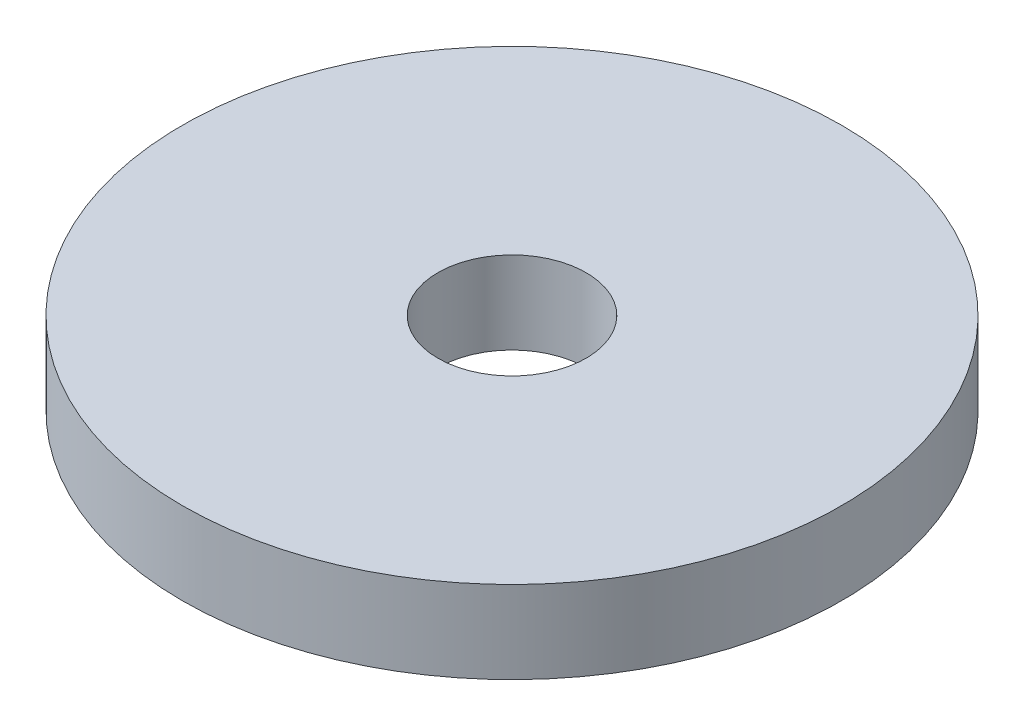
ISO-10303-21;
HEADER;
FILE_DESCRIPTION(('STEP AP214'),'2;1');
FILE_NAME('part.step','',(''),(''),'','','');
FILE_SCHEMA(('AUTOMOTIVE_DESIGN { 1 0 10303 214 1 1 1 1 }'));
ENDSEC;
DATA;
#1=APPLICATION_CONTEXT('core data for automotive mechanical design processes');
#2=APPLICATION_PROTOCOL_DEFINITION('international standard','automotive_design',2000,#1);
#3=PRODUCT_CONTEXT('',#1,'mechanical');
#4=PRODUCT('Part','Part','',(#3));
#5=PRODUCT_RELATED_PRODUCT_CATEGORY('part','',(#4));
#6=PRODUCT_DEFINITION_FORMATION('','',#4);
#7=PRODUCT_DEFINITION_CONTEXT('part definition',#1,'design');
#8=PRODUCT_DEFINITION('design','',#6,#7);
#9=PRODUCT_DEFINITION_SHAPE('','',#8);
#10=(LENGTH_UNIT() NAMED_UNIT(*) SI_UNIT(.MILLI.,.METRE.));
#11=(NAMED_UNIT(*) PLANE_ANGLE_UNIT() SI_UNIT($,.RADIAN.));
#12=(NAMED_UNIT(*) SI_UNIT($,.STERADIAN.) SOLID_ANGLE_UNIT());
#13=UNCERTAINTY_MEASURE_WITH_UNIT(LENGTH_MEASURE(1.E-05),#10,'distance_accuracy_value','');
#14=(GEOMETRIC_REPRESENTATION_CONTEXT(3) GLOBAL_UNCERTAINTY_ASSIGNED_CONTEXT((#13)) GLOBAL_UNIT_ASSIGNED_CONTEXT((#10,
#11,#12)) REPRESENTATION_CONTEXT('',''));
#15=CARTESIAN_POINT('',(0.,0.,0.));
#16=DIRECTION('',(0.,0.,1.));
#17=DIRECTION('',(1.,0.,0.));
#18=AXIS2_PLACEMENT_3D('',#15,#16,#17);
#19=CARTESIAN_POINT('',(0.,-5.,0.));
#20=DIRECTION('',(0.,1.,0.));
#21=DIRECTION('',(0.,0.,1.));
#22=AXIS2_PLACEMENT_3D('',#19,#20,#21);
#23=CYLINDRICAL_SURFACE('',#22,20.);
#24=CARTESIAN_POINT('',(0.,-5.,0.));
#25=DIRECTION('',(0.,1.,0.));
#26=DIRECTION('',(0.,0.,1.));
#27=AXIS2_PLACEMENT_3D('',#24,#25,#26);
#28=CIRCLE('',#27,20.);
#29=CARTESIAN_POINT('',(0.,-5.,20.));
#30=VERTEX_POINT('',#29);
#31=EDGE_CURVE('E10',#30,#30,#28,.T.);
#32=ORIENTED_EDGE('',*,*,#31,.T.);
#33=EDGE_LOOP('',(#32));
#34=FACE_BOUND('',#33,.T.);
#35=CARTESIAN_POINT('',(0.,0.,0.));
#36=DIRECTION('',(0.,1.,0.));
#37=DIRECTION('',(0.,0.,1.));
#38=AXIS2_PLACEMENT_3D('',#35,#36,#37);
#39=CIRCLE('',#38,20.);
#40=CARTESIAN_POINT('',(0.,0.,20.));
#41=VERTEX_POINT('',#40);
#42=EDGE_CURVE('E34',#41,#41,#39,.T.);
#43=ORIENTED_EDGE('',*,*,#42,.F.);
#44=EDGE_LOOP('',(#43));
#45=FACE_BOUND('',#44,.T.);
#46=ADVANCED_FACE('F31',(#34,#45),#23,.T.);
#47=CARTESIAN_POINT('',(0.,-5.,0.));
#48=DIRECTION('',(0.,1.,0.));
#49=DIRECTION('',(0.,0.,1.));
#50=AXIS2_PLACEMENT_3D('',#47,#48,#49);
#51=PLANE('',#50);
#52=CARTESIAN_POINT('',(0.,-5.,0.));
#53=DIRECTION('',(0.,1.,0.));
#54=DIRECTION('',(0.,0.,1.));
#55=AXIS2_PLACEMENT_3D('',#52,#53,#54);
#56=CIRCLE('',#55,4.5);
#57=CARTESIAN_POINT('',(0.,-5.,4.5));
#58=VERTEX_POINT('',#57);
#59=EDGE_CURVE('E41',#58,#58,#56,.T.);
#60=ORIENTED_EDGE('',*,*,#59,.T.);
#61=EDGE_LOOP('',(#60));
#62=FACE_BOUND('',#61,.T.);
#63=ORIENTED_EDGE('',*,*,#31,.F.);
#64=EDGE_LOOP('',(#63));
#65=FACE_BOUND('',#64,.T.);
#66=ADVANCED_FACE('F49',(#62,#65),#51,.F.);
#67=CARTESIAN_POINT('',(0.,0.,0.));
#68=DIRECTION('',(0.,1.,0.));
#69=DIRECTION('',(0.,0.,1.));
#70=AXIS2_PLACEMENT_3D('',#67,#68,#69);
#71=PLANE('',#70);
#72=CARTESIAN_POINT('',(0.,0.,0.));
#73=DIRECTION('',(0.,1.,0.));
#74=DIRECTION('',(0.,0.,1.));
#75=AXIS2_PLACEMENT_3D('',#72,#73,#74);
#76=CIRCLE('',#75,4.5);
#77=CARTESIAN_POINT('',(0.,0.,4.5));
#78=VERTEX_POINT('',#77);
#79=EDGE_CURVE('E43',#78,#78,#76,.T.);
#80=ORIENTED_EDGE('',*,*,#79,.F.);
#81=EDGE_LOOP('',(#80));
#82=FACE_BOUND('',#81,.T.);
#83=ORIENTED_EDGE('',*,*,#42,.T.);
#84=EDGE_LOOP('',(#83));
#85=FACE_BOUND('',#84,.T.);
#86=ADVANCED_FACE('F55',(#82,#85),#71,.T.);
#87=CARTESIAN_POINT('',(0.,-5.,0.));
#88=DIRECTION('',(0.,1.,0.));
#89=DIRECTION('',(0.,0.,1.));
#90=AXIS2_PLACEMENT_3D('',#87,#88,#89);
#91=CYLINDRICAL_SURFACE('',#90,4.5);
#92=ORIENTED_EDGE('',*,*,#59,.F.);
#93=EDGE_LOOP('',(#92));
#94=FACE_BOUND('',#93,.T.);
#95=ORIENTED_EDGE('',*,*,#79,.T.);
#96=EDGE_LOOP('',(#95));
#97=FACE_BOUND('',#96,.T.);
#98=ADVANCED_FACE('F52',(#94,#97),#91,.F.);
#99=CLOSED_SHELL('',(#46,#66,#86,#98));
#100=MANIFOLD_SOLID_BREP('B2',#99);
#101=ADVANCED_BREP_SHAPE_REPRESENTATION('',(#18,#100),#14);
#102=SHAPE_DEFINITION_REPRESENTATION(#9,#101);
ENDSEC;
END-ISO-10303-21;
